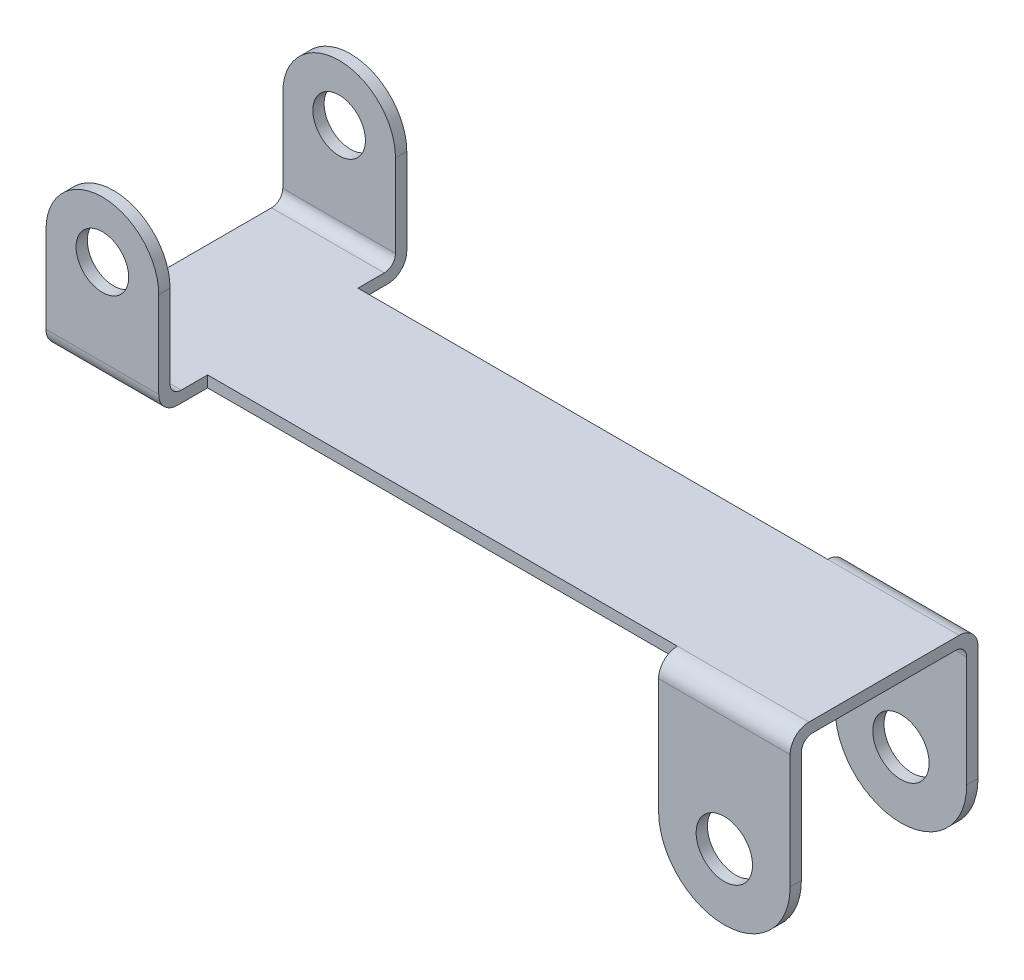
ISO-10303-21;
HEADER;
FILE_DESCRIPTION(('STEP AP214'),'2;1');
FILE_NAME('part.step','',(''),(''),'','','');
FILE_SCHEMA(('AUTOMOTIVE_DESIGN { 1 0 10303 214 1 1 1 1 }'));
ENDSEC;
DATA;
#1=APPLICATION_CONTEXT('core data for automotive mechanical design processes');
#2=APPLICATION_PROTOCOL_DEFINITION('international standard','automotive_design',2000,#1);
#3=PRODUCT_CONTEXT('',#1,'mechanical');
#4=PRODUCT('Part','Part','',(#3));
#5=PRODUCT_RELATED_PRODUCT_CATEGORY('part','',(#4));
#6=PRODUCT_DEFINITION_FORMATION('','',#4);
#7=PRODUCT_DEFINITION_CONTEXT('part definition',#1,'design');
#8=PRODUCT_DEFINITION('design','',#6,#7);
#9=PRODUCT_DEFINITION_SHAPE('','',#8);
#10=(LENGTH_UNIT() NAMED_UNIT(*) SI_UNIT(.MILLI.,.METRE.));
#11=(NAMED_UNIT(*) PLANE_ANGLE_UNIT() SI_UNIT($,.RADIAN.));
#12=(NAMED_UNIT(*) SI_UNIT($,.STERADIAN.) SOLID_ANGLE_UNIT());
#13=UNCERTAINTY_MEASURE_WITH_UNIT(LENGTH_MEASURE(1.E-05),#10,'distance_accuracy_value','');
#14=(GEOMETRIC_REPRESENTATION_CONTEXT(3) GLOBAL_UNCERTAINTY_ASSIGNED_CONTEXT((#13)) GLOBAL_UNIT_ASSIGNED_CONTEXT((#10,
#11,#12)) REPRESENTATION_CONTEXT('',''));
#15=CARTESIAN_POINT('',(0.,0.,0.));
#16=DIRECTION('',(0.,0.,1.));
#17=DIRECTION('',(1.,0.,0.));
#18=AXIS2_PLACEMENT_3D('',#15,#16,#17);
#19=CARTESIAN_POINT('',(17.25,-3.25,-0.5));
#20=DIRECTION('',(0.,0.,-1.));
#21=DIRECTION('',(-1.,0.,0.));
#22=AXIS2_PLACEMENT_3D('',#19,#20,#21);
#23=CYLINDRICAL_SURFACE('',#22,1.75);
#24=DIRECTION('',(0.,0.,1.));
#25=VECTOR('',#24,1.);
#26=CARTESIAN_POINT('',(15.5,-3.25,-0.5));
#27=LINE('',#26,#25);
#28=CARTESIAN_POINT('',(15.5,-3.25,-0.5));
#29=VERTEX_POINT('',#28);
#30=CARTESIAN_POINT('',(15.5,-3.25,-0.2));
#31=VERTEX_POINT('',#30);
#32=EDGE_CURVE('E305',#29,#31,#27,.T.);
#33=ORIENTED_EDGE('',*,*,#32,.F.);
#34=CARTESIAN_POINT('',(17.25,-3.25,-0.5));
#35=DIRECTION('',(0.,0.,-1.));
#36=DIRECTION('',(-1.,0.,0.));
#37=AXIS2_PLACEMENT_3D('',#34,#35,#36);
#38=CIRCLE('',#37,1.75);
#39=CARTESIAN_POINT('',(19.,-3.25,-0.5));
#40=VERTEX_POINT('',#39);
#41=EDGE_CURVE('E311',#40,#29,#38,.T.);
#42=ORIENTED_EDGE('',*,*,#41,.F.);
#43=DIRECTION('',(0.,0.,-1.));
#44=VECTOR('',#43,1.);
#45=CARTESIAN_POINT('',(19.,-3.25,0.));
#46=LINE('',#45,#44);
#47=CARTESIAN_POINT('',(19.,-3.25,-0.2));
#48=VERTEX_POINT('',#47);
#49=EDGE_CURVE('E308',#48,#40,#46,.T.);
#50=ORIENTED_EDGE('',*,*,#49,.F.);
#51=CARTESIAN_POINT('',(17.25,-3.25,-0.2));
#52=DIRECTION('',(0.,0.,-1.));
#53=DIRECTION('',(-1.,0.,0.));
#54=AXIS2_PLACEMENT_3D('',#51,#52,#53);
#55=CIRCLE('',#54,1.75);
#56=EDGE_CURVE('E313',#31,#48,#55,.F.);
#57=ORIENTED_EDGE('',*,*,#56,.F.);
#58=EDGE_LOOP('',(#33,#42,#50,#57));
#59=FACE_BOUND('',#58,.T.);
#60=ADVANCED_FACE('F39',(#59),#23,.T.);
#61=CARTESIAN_POINT('',(17.25,-3.25,4.2));
#62=DIRECTION('',(0.,0.,-1.));
#63=DIRECTION('',(-1.,0.,0.));
#64=AXIS2_PLACEMENT_3D('',#61,#62,#63);
#65=CYLINDRICAL_SURFACE('',#64,1.75);
#66=DIRECTION('',(0.,0.,-1.));
#67=VECTOR('',#66,1.);
#68=CARTESIAN_POINT('',(15.5,-3.25,4.));
#69=LINE('',#68,#67);
#70=CARTESIAN_POINT('',(15.5,-3.25,4.2));
#71=VERTEX_POINT('',#70);
#72=CARTESIAN_POINT('',(15.5,-3.25,4.5));
#73=VERTEX_POINT('',#72);
#74=EDGE_CURVE('E290',#71,#73,#69,.F.);
#75=ORIENTED_EDGE('',*,*,#74,.F.);
#76=CARTESIAN_POINT('',(17.25,-3.25,4.2));
#77=DIRECTION('',(0.,0.,1.));
#78=DIRECTION('',(1.,0.,0.));
#79=AXIS2_PLACEMENT_3D('',#76,#77,#78);
#80=CIRCLE('',#79,1.75);
#81=CARTESIAN_POINT('',(19.,-3.25,4.2));
#82=VERTEX_POINT('',#81);
#83=EDGE_CURVE('E301',#82,#71,#80,.F.);
#84=ORIENTED_EDGE('',*,*,#83,.F.);
#85=DIRECTION('',(0.,0.,1.));
#86=VECTOR('',#85,1.);
#87=CARTESIAN_POINT('',(19.,-3.25,4.2));
#88=LINE('',#87,#86);
#89=CARTESIAN_POINT('',(19.,-3.25,4.5));
#90=VERTEX_POINT('',#89);
#91=EDGE_CURVE('E298',#90,#82,#88,.F.);
#92=ORIENTED_EDGE('',*,*,#91,.F.);
#93=CARTESIAN_POINT('',(17.25,-3.25,4.5));
#94=DIRECTION('',(0.,0.,1.));
#95=DIRECTION('',(1.,0.,0.));
#96=AXIS2_PLACEMENT_3D('',#93,#94,#95);
#97=CIRCLE('',#96,1.75);
#98=EDGE_CURVE('E303',#73,#90,#97,.T.);
#99=ORIENTED_EDGE('',*,*,#98,.F.);
#100=EDGE_LOOP('',(#75,#84,#92,#99));
#101=FACE_BOUND('',#100,.T.);
#102=ADVANCED_FACE('F501',(#101),#65,.T.);
#103=CARTESIAN_POINT('',(0.,0.,0.));
#104=DIRECTION('',(0.,1.,0.));
#105=DIRECTION('',(0.,0.,1.));
#106=AXIS2_PLACEMENT_3D('',#103,#104,#105);
#107=PLANE('',#106);
#108=DIRECTION('',(0.,0.,1.));
#109=VECTOR('',#108,1.);
#110=CARTESIAN_POINT('',(3.,0.,4.));
#111=LINE('',#110,#109);
#112=CARTESIAN_POINT('',(3.,0.,4.));
#113=VERTEX_POINT('',#112);
#114=CARTESIAN_POINT('',(3.,0.,4.8));
#115=VERTEX_POINT('',#114);
#116=EDGE_CURVE('E238',#113,#115,#111,.T.);
#117=ORIENTED_EDGE('',*,*,#116,.T.);
#118=DIRECTION('',(-1.,0.,0.));
#119=VECTOR('',#118,1.);
#120=CARTESIAN_POINT('',(0.,0.,4.8));
#121=LINE('',#120,#119);
#122=CARTESIAN_POINT('',(0.,0.,4.8));
#123=VERTEX_POINT('',#122);
#124=EDGE_CURVE('E364',#115,#123,#121,.T.);
#125=ORIENTED_EDGE('',*,*,#124,.T.);
#126=DIRECTION('',(0.,0.,1.));
#127=VECTOR('',#126,1.);
#128=CARTESIAN_POINT('',(0.,0.,0.));
#129=LINE('',#128,#127);
#130=CARTESIAN_POINT('',(0.,0.,-0.8));
#131=VERTEX_POINT('',#130);
#132=EDGE_CURVE('E260',#131,#123,#129,.T.);
#133=ORIENTED_EDGE('',*,*,#132,.F.);
#134=DIRECTION('',(1.,0.,0.));
#135=VECTOR('',#134,1.);
#136=CARTESIAN_POINT('',(3.,0.,-0.8));
#137=LINE('',#136,#135);
#138=CARTESIAN_POINT('',(3.,0.,-0.8));
#139=VERTEX_POINT('',#138);
#140=EDGE_CURVE('E361',#131,#139,#137,.T.);
#141=ORIENTED_EDGE('',*,*,#140,.T.);
#142=DIRECTION('',(0.,0.,1.));
#143=VECTOR('',#142,1.);
#144=CARTESIAN_POINT('',(3.,0.,0.));
#145=LINE('',#144,#143);
#146=CARTESIAN_POINT('',(3.,0.,0.));
#147=VERTEX_POINT('',#146);
#148=EDGE_CURVE('E449',#139,#147,#145,.T.);
#149=ORIENTED_EDGE('',*,*,#148,.T.);
#150=DIRECTION('',(-1.,0.,0.));
#151=VECTOR('',#150,1.);
#152=CARTESIAN_POINT('',(0.,0.,0.));
#153=LINE('',#152,#151);
#154=CARTESIAN_POINT('',(15.5,0.,0.));
#155=VERTEX_POINT('',#154);
#156=EDGE_CURVE('E253',#155,#147,#153,.T.);
#157=ORIENTED_EDGE('',*,*,#156,.F.);
#158=DIRECTION('',(0.,0.,1.));
#159=VECTOR('',#158,1.);
#160=CARTESIAN_POINT('',(15.5,0.,0.));
#161=LINE('',#160,#159);
#162=CARTESIAN_POINT('',(15.5,0.,0.0999999999999998));
#163=VERTEX_POINT('',#162);
#164=EDGE_CURVE('E325',#155,#163,#161,.T.);
#165=ORIENTED_EDGE('',*,*,#164,.T.);
#166=DIRECTION('',(-1.,0.,0.));
#167=VECTOR('',#166,1.);
#168=CARTESIAN_POINT('',(19.,0.,0.0999999999999998));
#169=LINE('',#168,#167);
#170=CARTESIAN_POINT('',(19.,0.,0.0999999999999998));
#171=VERTEX_POINT('',#170);
#172=EDGE_CURVE('E323',#163,#171,#169,.F.);
#173=ORIENTED_EDGE('',*,*,#172,.T.);
#174=DIRECTION('',(0.,0.,-1.));
#175=VECTOR('',#174,1.);
#176=CARTESIAN_POINT('',(19.,0.,0.));
#177=LINE('',#176,#175);
#178=CARTESIAN_POINT('',(19.,0.,3.9));
#179=VERTEX_POINT('',#178);
#180=EDGE_CURVE('E266',#179,#171,#177,.T.);
#181=ORIENTED_EDGE('',*,*,#180,.F.);
#182=DIRECTION('',(1.,0.,0.));
#183=VECTOR('',#182,1.);
#184=CARTESIAN_POINT('',(15.5,0.,3.9));
#185=LINE('',#184,#183);
#186=CARTESIAN_POINT('',(15.5,0.,3.9));
#187=VERTEX_POINT('',#186);
#188=EDGE_CURVE('E330',#179,#187,#185,.F.);
#189=ORIENTED_EDGE('',*,*,#188,.T.);
#190=DIRECTION('',(0.,0.,1.));
#191=VECTOR('',#190,1.);
#192=CARTESIAN_POINT('',(15.5,0.,0.));
#193=LINE('',#192,#191);
#194=CARTESIAN_POINT('',(15.5,0.,4.));
#195=VERTEX_POINT('',#194);
#196=EDGE_CURVE('E328',#187,#195,#193,.T.);
#197=ORIENTED_EDGE('',*,*,#196,.T.);
#198=DIRECTION('',(1.,0.,0.));
#199=VECTOR('',#198,1.);
#200=CARTESIAN_POINT('',(0.,0.,4.));
#201=LINE('',#200,#199);
#202=EDGE_CURVE('E263',#113,#195,#201,.T.);
#203=ORIENTED_EDGE('',*,*,#202,.F.);
#204=EDGE_LOOP('',(#117,#125,#133,#141,#149,#157,#165,#173,#181,#189,#197,#203));
#205=FACE_BOUND('',#204,.T.);
#206=ADVANCED_FACE('F472',(#205),#107,.F.);
#207=CARTESIAN_POINT('',(1.5,2.8,5.));
#208=DIRECTION('',(0.,0.,-1.));
#209=DIRECTION('',(-1.,0.,0.));
#210=AXIS2_PLACEMENT_3D('',#207,#208,#209);
#211=CYLINDRICAL_SURFACE('',#210,1.5);
#212=DIRECTION('',(0.,0.,-1.));
#213=VECTOR('',#212,1.);
#214=CARTESIAN_POINT('',(3.,2.8,4.));
#215=LINE('',#214,#213);
#216=CARTESIAN_POINT('',(3.,2.8,5.));
#217=VERTEX_POINT('',#216);
#218=CARTESIAN_POINT('',(3.,2.8,5.3));
#219=VERTEX_POINT('',#218);
#220=EDGE_CURVE('E280',#217,#219,#215,.F.);
#221=ORIENTED_EDGE('',*,*,#220,.F.);
#222=CARTESIAN_POINT('',(1.5,2.8,5.));
#223=DIRECTION('',(0.,0.,1.));
#224=DIRECTION('',(1.,0.,0.));
#225=AXIS2_PLACEMENT_3D('',#222,#223,#224);
#226=CIRCLE('',#225,1.5);
#227=CARTESIAN_POINT('',(0.,2.8,5.));
#228=VERTEX_POINT('',#227);
#229=EDGE_CURVE('E286',#228,#217,#226,.F.);
#230=ORIENTED_EDGE('',*,*,#229,.F.);
#231=DIRECTION('',(0.,0.,1.));
#232=VECTOR('',#231,1.);
#233=CARTESIAN_POINT('',(0.,2.8,5.));
#234=LINE('',#233,#232);
#235=CARTESIAN_POINT('',(0.,2.8,5.3));
#236=VERTEX_POINT('',#235);
#237=EDGE_CURVE('E283',#236,#228,#234,.F.);
#238=ORIENTED_EDGE('',*,*,#237,.F.);
#239=CARTESIAN_POINT('',(1.5,2.8,5.3));
#240=DIRECTION('',(0.,0.,1.));
#241=DIRECTION('',(1.,0.,0.));
#242=AXIS2_PLACEMENT_3D('',#239,#240,#241);
#243=CIRCLE('',#242,1.5);
#244=EDGE_CURVE('E288',#219,#236,#243,.T.);
#245=ORIENTED_EDGE('',*,*,#244,.F.);
#246=EDGE_LOOP('',(#221,#230,#238,#245));
#247=FACE_BOUND('',#246,.T.);
#248=ADVANCED_FACE('F692',(#247),#211,.T.);
#249=CARTESIAN_POINT('',(1.5,2.8,-1.3));
#250=DIRECTION('',(0.,0.,-1.));
#251=DIRECTION('',(-1.,0.,0.));
#252=AXIS2_PLACEMENT_3D('',#249,#250,#251);
#253=CYLINDRICAL_SURFACE('',#252,1.5);
#254=DIRECTION('',(0.,0.,-1.));
#255=VECTOR('',#254,1.);
#256=CARTESIAN_POINT('',(3.,2.8,0.));
#257=LINE('',#256,#255);
#258=CARTESIAN_POINT('',(3.,2.8,-1.3));
#259=VERTEX_POINT('',#258);
#260=CARTESIAN_POINT('',(3.,2.8,-1.));
#261=VERTEX_POINT('',#260);
#262=EDGE_CURVE('E259',#259,#261,#257,.F.);
#263=ORIENTED_EDGE('',*,*,#262,.F.);
#264=CARTESIAN_POINT('',(1.5,2.8,-1.3));
#265=DIRECTION('',(0.,0.,-1.));
#266=DIRECTION('',(-1.,0.,0.));
#267=AXIS2_PLACEMENT_3D('',#264,#265,#266);
#268=CIRCLE('',#267,1.5);
#269=CARTESIAN_POINT('',(0.,2.8,-1.3));
#270=VERTEX_POINT('',#269);
#271=EDGE_CURVE('E276',#270,#259,#268,.T.);
#272=ORIENTED_EDGE('',*,*,#271,.F.);
#273=DIRECTION('',(0.,0.,1.));
#274=VECTOR('',#273,1.);
#275=CARTESIAN_POINT('',(0.,2.8,-1.3));
#276=LINE('',#275,#274);
#277=CARTESIAN_POINT('',(0.,2.8,-1.));
#278=VERTEX_POINT('',#277);
#279=EDGE_CURVE('E273',#278,#270,#276,.F.);
#280=ORIENTED_EDGE('',*,*,#279,.F.);
#281=CARTESIAN_POINT('',(1.5,2.8,-1.));
#282=DIRECTION('',(0.,0.,-1.));
#283=DIRECTION('',(-1.,0.,0.));
#284=AXIS2_PLACEMENT_3D('',#281,#282,#283);
#285=CIRCLE('',#284,1.5);
#286=EDGE_CURVE('E278',#261,#278,#285,.F.);
#287=ORIENTED_EDGE('',*,*,#286,.F.);
#288=EDGE_LOOP('',(#263,#272,#280,#287));
#289=FACE_BOUND('',#288,.T.);
#290=ADVANCED_FACE('F487',(#289),#253,.T.);
#291=CARTESIAN_POINT('',(0.,0.3,0.));
#292=DIRECTION('',(0.,1.,0.));
#293=DIRECTION('',(0.,0.,1.));
#294=AXIS2_PLACEMENT_3D('',#291,#292,#293);
#295=PLANE('',#294);
#296=DIRECTION('',(1.,0.,0.));
#297=VECTOR('',#296,1.);
#298=CARTESIAN_POINT('',(0.,0.3,4.));
#299=LINE('',#298,#297);
#300=CARTESIAN_POINT('',(3.,0.3,4.));
#301=VERTEX_POINT('',#300);
#302=CARTESIAN_POINT('',(15.5,0.3,4.));
#303=VERTEX_POINT('',#302);
#304=EDGE_CURVE('E224',#301,#303,#299,.T.);
#305=ORIENTED_EDGE('',*,*,#304,.T.);
#306=DIRECTION('',(1.,0.,0.));
#307=VECTOR('',#306,1.);
#308=CARTESIAN_POINT('',(0.,0.3,4.00000000000001));
#309=LINE('',#308,#307);
#310=CARTESIAN_POINT('',(19.,0.3,4.));
#311=VERTEX_POINT('',#310);
#312=EDGE_CURVE('E382',#303,#311,#309,.T.);
#313=ORIENTED_EDGE('',*,*,#312,.T.);
#314=DIRECTION('',(0.,0.,-1.));
#315=VECTOR('',#314,1.);
#316=CARTESIAN_POINT('',(19.,0.3,0.));
#317=LINE('',#316,#315);
#318=CARTESIAN_POINT('',(19.,0.3,0.));
#319=VERTEX_POINT('',#318);
#320=EDGE_CURVE('E247',#311,#319,#317,.T.);
#321=ORIENTED_EDGE('',*,*,#320,.T.);
#322=DIRECTION('',(-1.,0.,0.));
#323=VECTOR('',#322,1.);
#324=CARTESIAN_POINT('',(0.,0.3,0.));
#325=LINE('',#324,#323);
#326=CARTESIAN_POINT('',(15.5,0.3,0.));
#327=VERTEX_POINT('',#326);
#328=EDGE_CURVE('E379',#319,#327,#325,.T.);
#329=ORIENTED_EDGE('',*,*,#328,.T.);
#330=DIRECTION('',(-1.,0.,0.));
#331=VECTOR('',#330,1.);
#332=CARTESIAN_POINT('',(0.,0.3,0.));
#333=LINE('',#332,#331);
#334=CARTESIAN_POINT('',(3.,0.3,0.));
#335=VERTEX_POINT('',#334);
#336=EDGE_CURVE('E251',#327,#335,#333,.T.);
#337=ORIENTED_EDGE('',*,*,#336,.T.);
#338=DIRECTION('',(0.,0.,1.));
#339=VECTOR('',#338,1.);
#340=CARTESIAN_POINT('',(3.,0.3,0.));
#341=LINE('',#340,#339);
#342=CARTESIAN_POINT('',(3.,0.3,-0.7));
#343=VERTEX_POINT('',#342);
#344=EDGE_CURVE('E453',#343,#335,#341,.T.);
#345=ORIENTED_EDGE('',*,*,#344,.F.);
#346=DIRECTION('',(1.,0.,0.));
#347=VECTOR('',#346,1.);
#348=CARTESIAN_POINT('',(0.,0.3,-0.7));
#349=LINE('',#348,#347);
#350=CARTESIAN_POINT('',(0.,0.3,-0.7));
#351=VERTEX_POINT('',#350);
#352=EDGE_CURVE('E340',#343,#351,#349,.F.);
#353=ORIENTED_EDGE('',*,*,#352,.T.);
#354=DIRECTION('',(0.,0.,1.));
#355=VECTOR('',#354,1.);
#356=CARTESIAN_POINT('',(0.,0.3,0.));
#357=LINE('',#356,#355);
#358=CARTESIAN_POINT('',(0.,0.3,4.7));
#359=VERTEX_POINT('',#358);
#360=EDGE_CURVE('E248',#351,#359,#357,.T.);
#361=ORIENTED_EDGE('',*,*,#360,.T.);
#362=DIRECTION('',(-1.,0.,0.));
#363=VECTOR('',#362,1.);
#364=CARTESIAN_POINT('',(0.,0.3,4.7));
#365=LINE('',#364,#363);
#366=CARTESIAN_POINT('',(3.,0.3,4.7));
#367=VERTEX_POINT('',#366);
#368=EDGE_CURVE('E228',#359,#367,#365,.F.);
#369=ORIENTED_EDGE('',*,*,#368,.T.);
#370=DIRECTION('',(0.,0.,1.));
#371=VECTOR('',#370,1.);
#372=CARTESIAN_POINT('',(3.,0.3,4.));
#373=LINE('',#372,#371);
#374=EDGE_CURVE('E219',#301,#367,#373,.T.);
#375=ORIENTED_EDGE('',*,*,#374,.F.);
#376=EDGE_LOOP('',(#305,#313,#321,#329,#337,#345,#353,#361,#369,#375));
#377=FACE_BOUND('',#376,.T.);
#378=ADVANCED_FACE('F221',(#377),#295,.T.);
#379=CARTESIAN_POINT('',(0.,0.3,0.));
#380=DIRECTION('',(0.,0.,1.));
#381=DIRECTION('',(1.,0.,0.));
#382=AXIS2_PLACEMENT_3D('',#379,#380,#381);
#383=PLANE('',#382);
#384=ORIENTED_EDGE('',*,*,#336,.F.);
#385=DIRECTION('',(0.,1.,0.));
#386=VECTOR('',#385,1.);
#387=CARTESIAN_POINT('',(15.5,-3.53553390593274,0.));
#388=LINE('',#387,#386);
#389=EDGE_CURVE('E413',#155,#327,#388,.T.);
#390=ORIENTED_EDGE('',*,*,#389,.F.);
#391=ORIENTED_EDGE('',*,*,#156,.T.);
#392=DIRECTION('',(0.,-1.,0.));
#393=VECTOR('',#392,1.);
#394=CARTESIAN_POINT('',(3.,3.56955654485436,0.));
#395=LINE('',#394,#393);
#396=EDGE_CURVE('E415',#335,#147,#395,.T.);
#397=ORIENTED_EDGE('',*,*,#396,.F.);
#398=EDGE_LOOP('',(#384,#390,#391,#397));
#399=FACE_BOUND('',#398,.T.);
#400=ADVANCED_FACE('F412',(#399),#383,.F.);
#401=CARTESIAN_POINT('',(0.,0.3,0.));
#402=DIRECTION('',(1.,0.,0.));
#403=DIRECTION('',(0.,0.,-1.));
#404=AXIS2_PLACEMENT_3D('',#401,#402,#403);
#405=PLANE('',#404);
#406=ORIENTED_EDGE('',*,*,#132,.T.);
#407=CARTESIAN_POINT('',(0.,0.5,4.8));
#408=DIRECTION('',(1.,0.,0.));
#409=DIRECTION('',(0.,0.,-1.));
#410=AXIS2_PLACEMENT_3D('',#407,#408,#409);
#411=CIRCLE('',#410,0.5);
#412=CARTESIAN_POINT('',(0.,0.5,5.3));
#413=VERTEX_POINT('',#412);
#414=EDGE_CURVE('E369',#123,#413,#411,.F.);
#415=ORIENTED_EDGE('',*,*,#414,.T.);
#416=DIRECTION('',(0.,-1.,0.));
#417=VECTOR('',#416,1.);
#418=CARTESIAN_POINT('',(0.,3.56955654485436,5.3));
#419=LINE('',#418,#417);
#420=EDGE_CURVE('E446',#236,#413,#419,.T.);
#421=ORIENTED_EDGE('',*,*,#420,.F.);
#422=ORIENTED_EDGE('',*,*,#237,.T.);
#423=DIRECTION('',(0.,-1.,0.));
#424=VECTOR('',#423,1.);
#425=CARTESIAN_POINT('',(0.,4.3,5.));
#426=LINE('',#425,#424);
#427=CARTESIAN_POINT('',(0.,0.6,5.));
#428=VERTEX_POINT('',#427);
#429=EDGE_CURVE('E433',#228,#428,#426,.T.);
#430=ORIENTED_EDGE('',*,*,#429,.T.);
#431=CARTESIAN_POINT('',(0.,0.6,4.7));
#432=DIRECTION('',(1.,0.,0.));
#433=DIRECTION('',(0.,0.,-1.));
#434=AXIS2_PLACEMENT_3D('',#431,#432,#433);
#435=CIRCLE('',#434,0.3);
#436=EDGE_CURVE('E357',#428,#359,#435,.T.);
#437=ORIENTED_EDGE('',*,*,#436,.T.);
#438=ORIENTED_EDGE('',*,*,#360,.F.);
#439=CARTESIAN_POINT('',(0.,0.6,-0.7));
#440=DIRECTION('',(1.,0.,0.));
#441=DIRECTION('',(0.,0.,-1.));
#442=AXIS2_PLACEMENT_3D('',#439,#440,#441);
#443=CIRCLE('',#442,0.3);
#444=CARTESIAN_POINT('',(0.,0.6,-1.));
#445=VERTEX_POINT('',#444);
#446=EDGE_CURVE('E355',#351,#445,#443,.T.);
#447=ORIENTED_EDGE('',*,*,#446,.T.);
#448=DIRECTION('',(0.,-1.,0.));
#449=VECTOR('',#448,1.);
#450=CARTESIAN_POINT('',(0.,4.3,-1.));
#451=LINE('',#450,#449);
#452=EDGE_CURVE('E442',#278,#445,#451,.T.);
#453=ORIENTED_EDGE('',*,*,#452,.F.);
#454=ORIENTED_EDGE('',*,*,#279,.T.);
#455=DIRECTION('',(0.,-1.,0.));
#456=VECTOR('',#455,1.);
#457=CARTESIAN_POINT('',(0.,3.56955654485436,-1.3));
#458=LINE('',#457,#456);
#459=CARTESIAN_POINT('',(0.,0.5,-1.3));
#460=VERTEX_POINT('',#459);
#461=EDGE_CURVE('E264',#270,#460,#458,.T.);
#462=ORIENTED_EDGE('',*,*,#461,.T.);
#463=CARTESIAN_POINT('',(0.,0.5,-0.8));
#464=DIRECTION('',(1.,0.,0.));
#465=DIRECTION('',(0.,0.,-1.));
#466=AXIS2_PLACEMENT_3D('',#463,#464,#465);
#467=CIRCLE('',#466,0.5);
#468=EDGE_CURVE('E367',#460,#131,#467,.F.);
#469=ORIENTED_EDGE('',*,*,#468,.T.);
#470=EDGE_LOOP('',(#406,#415,#421,#422,#430,#437,#438,#447,#453,#454,#462,#469));
#471=FACE_BOUND('',#470,.T.);
#472=ADVANCED_FACE('F461',(#471),#405,.F.);
#473=CARTESIAN_POINT('',(0.,0.3,4.));
#474=DIRECTION('',(0.,0.,-1.));
#475=DIRECTION('',(-1.,0.,0.));
#476=AXIS2_PLACEMENT_3D('',#473,#474,#475);
#477=PLANE('',#476);
#478=ORIENTED_EDGE('',*,*,#202,.T.);
#479=DIRECTION('',(0.,1.,0.));
#480=VECTOR('',#479,1.);
#481=CARTESIAN_POINT('',(15.5,-3.53553390593274,4.));
#482=LINE('',#481,#480);
#483=EDGE_CURVE('E246',#195,#303,#482,.T.);
#484=ORIENTED_EDGE('',*,*,#483,.T.);
#485=ORIENTED_EDGE('',*,*,#304,.F.);
#486=DIRECTION('',(0.,-1.,0.));
#487=VECTOR('',#486,1.);
#488=CARTESIAN_POINT('',(3.,3.56955654485436,4.));
#489=LINE('',#488,#487);
#490=EDGE_CURVE('E232',#301,#113,#489,.T.);
#491=ORIENTED_EDGE('',*,*,#490,.T.);
#492=EDGE_LOOP('',(#478,#484,#485,#491));
#493=FACE_BOUND('',#492,.T.);
#494=ADVANCED_FACE('F244',(#493),#477,.F.);
#495=CARTESIAN_POINT('',(19.,0.3,0.));
#496=DIRECTION('',(-1.,0.,0.));
#497=DIRECTION('',(0.,0.,1.));
#498=AXIS2_PLACEMENT_3D('',#495,#496,#497);
#499=PLANE('',#498);
#500=ORIENTED_EDGE('',*,*,#320,.F.);
#501=CARTESIAN_POINT('',(19.,-0.2,4.));
#502=DIRECTION('',(-1.,0.,0.));
#503=DIRECTION('',(0.,0.,1.));
#504=AXIS2_PLACEMENT_3D('',#501,#502,#503);
#505=CIRCLE('',#504,0.5);
#506=CARTESIAN_POINT('',(19.,-0.2,4.5));
#507=VERTEX_POINT('',#506);
#508=EDGE_CURVE('E386',#311,#507,#505,.F.);
#509=ORIENTED_EDGE('',*,*,#508,.T.);
#510=DIRECTION('',(0.,1.,0.));
#511=VECTOR('',#510,1.);
#512=CARTESIAN_POINT('',(19.,-3.53553390593274,4.5));
#513=LINE('',#512,#511);
#514=EDGE_CURVE('E428',#90,#507,#513,.T.);
#515=ORIENTED_EDGE('',*,*,#514,.F.);
#516=ORIENTED_EDGE('',*,*,#91,.T.);
#517=DIRECTION('',(0.,1.,0.));
#518=VECTOR('',#517,1.);
#519=CARTESIAN_POINT('',(19.,-5.,4.2));
#520=LINE('',#519,#518);
#521=CARTESIAN_POINT('',(19.,-0.3,4.2));
#522=VERTEX_POINT('',#521);
#523=EDGE_CURVE('E825',#82,#522,#520,.T.);
#524=ORIENTED_EDGE('',*,*,#523,.T.);
#525=CARTESIAN_POINT('',(19.,-0.3,3.9));
#526=DIRECTION('',(-1.,0.,0.));
#527=DIRECTION('',(0.,0.,1.));
#528=AXIS2_PLACEMENT_3D('',#525,#526,#527);
#529=CIRCLE('',#528,0.3);
#530=EDGE_CURVE('E345',#522,#179,#529,.T.);
#531=ORIENTED_EDGE('',*,*,#530,.T.);
#532=ORIENTED_EDGE('',*,*,#180,.T.);
#533=CARTESIAN_POINT('',(19.,-0.3,0.0999999999999998));
#534=DIRECTION('',(-1.,0.,0.));
#535=DIRECTION('',(0.,0.,1.));
#536=AXIS2_PLACEMENT_3D('',#533,#534,#535);
#537=CIRCLE('',#536,0.3);
#538=CARTESIAN_POINT('',(19.,-0.3,-0.2));
#539=VERTEX_POINT('',#538);
#540=EDGE_CURVE('E351',#171,#539,#537,.T.);
#541=ORIENTED_EDGE('',*,*,#540,.T.);
#542=DIRECTION('',(0.,1.,0.));
#543=VECTOR('',#542,1.);
#544=CARTESIAN_POINT('',(19.,-5.,-0.2));
#545=LINE('',#544,#543);
#546=EDGE_CURVE('E832',#48,#539,#545,.T.);
#547=ORIENTED_EDGE('',*,*,#546,.F.);
#548=ORIENTED_EDGE('',*,*,#49,.T.);
#549=DIRECTION('',(0.,1.,0.));
#550=VECTOR('',#549,1.);
#551=CARTESIAN_POINT('',(19.,-3.53553390593274,-0.5));
#552=LINE('',#551,#550);
#553=CARTESIAN_POINT('',(19.,-0.2,-0.5));
#554=VERTEX_POINT('',#553);
#555=EDGE_CURVE('E404',#40,#554,#552,.T.);
#556=ORIENTED_EDGE('',*,*,#555,.T.);
#557=CARTESIAN_POINT('',(19.,-0.2,0.));
#558=DIRECTION('',(-1.,0.,0.));
#559=DIRECTION('',(0.,0.,1.));
#560=AXIS2_PLACEMENT_3D('',#557,#558,#559);
#561=CIRCLE('',#560,0.5);
#562=EDGE_CURVE('E384',#554,#319,#561,.F.);
#563=ORIENTED_EDGE('',*,*,#562,.T.);
#564=EDGE_LOOP('',(#500,#509,#515,#516,#524,#531,#532,#541,#547,#548,#556,#563));
#565=FACE_BOUND('',#564,.T.);
#566=ADVANCED_FACE('F399',(#565),#499,.F.);
#567=CARTESIAN_POINT('',(0.,3.56955654485436,-1.3));
#568=DIRECTION('',(0.,0.,-1.));
#569=DIRECTION('',(-1.,0.,0.));
#570=AXIS2_PLACEMENT_3D('',#567,#568,#569);
#571=PLANE('',#570);
#572=CARTESIAN_POINT('',(1.5,2.79999999999999,-1.3));
#573=DIRECTION('',(0.,0.,-1.));
#574=DIRECTION('',(-1.,0.,0.));
#575=AXIS2_PLACEMENT_3D('',#572,#573,#574);
#576=CIRCLE('',#575,0.7);
#577=CARTESIAN_POINT('',(0.8,2.79999999999999,-1.3));
#578=VERTEX_POINT('',#577);
#579=EDGE_CURVE('E418',#578,#578,#576,.T.);
#580=ORIENTED_EDGE('',*,*,#579,.F.);
#581=EDGE_LOOP('',(#580));
#582=FACE_BOUND('',#581,.T.);
#583=DIRECTION('',(0.,-1.,0.));
#584=VECTOR('',#583,1.);
#585=CARTESIAN_POINT('',(3.,3.56955654485436,-1.3));
#586=LINE('',#585,#584);
#587=CARTESIAN_POINT('',(3.,0.5,-1.3));
#588=VERTEX_POINT('',#587);
#589=EDGE_CURVE('E452',#259,#588,#586,.T.);
#590=ORIENTED_EDGE('',*,*,#589,.T.);
#591=DIRECTION('',(1.,0.,0.));
#592=VECTOR('',#591,1.);
#593=CARTESIAN_POINT('',(0.,0.5,-1.3));
#594=LINE('',#593,#592);
#595=EDGE_CURVE('E377',#588,#460,#594,.F.);
#596=ORIENTED_EDGE('',*,*,#595,.T.);
#597=ORIENTED_EDGE('',*,*,#461,.F.);
#598=ORIENTED_EDGE('',*,*,#271,.T.);
#599=EDGE_LOOP('',(#590,#596,#597,#598));
#600=FACE_BOUND('',#599,.T.);
#601=ADVANCED_FACE('F488',(#582,#600),#571,.T.);
#602=CARTESIAN_POINT('',(3.,3.56955654485436,0.));
#603=DIRECTION('',(1.,0.,0.));
#604=DIRECTION('',(0.,0.,-1.));
#605=AXIS2_PLACEMENT_3D('',#602,#603,#604);
#606=PLANE('',#605);
#607=ORIENTED_EDGE('',*,*,#148,.F.);
#608=CARTESIAN_POINT('',(3.,0.5,-0.8));
#609=DIRECTION('',(1.,0.,0.));
#610=DIRECTION('',(0.,0.,-1.));
#611=AXIS2_PLACEMENT_3D('',#608,#609,#610);
#612=CIRCLE('',#611,0.5);
#613=EDGE_CURVE('E375',#139,#588,#612,.T.);
#614=ORIENTED_EDGE('',*,*,#613,.T.);
#615=ORIENTED_EDGE('',*,*,#589,.F.);
#616=ORIENTED_EDGE('',*,*,#262,.T.);
#617=DIRECTION('',(0.,-1.,0.));
#618=VECTOR('',#617,1.);
#619=CARTESIAN_POINT('',(3.,4.3,-1.));
#620=LINE('',#619,#618);
#621=CARTESIAN_POINT('',(3.,0.6,-1.));
#622=VERTEX_POINT('',#621);
#623=EDGE_CURVE('E439',#261,#622,#620,.T.);
#624=ORIENTED_EDGE('',*,*,#623,.T.);
#625=CARTESIAN_POINT('',(3.,0.6,-0.7));
#626=DIRECTION('',(1.,0.,0.));
#627=DIRECTION('',(0.,0.,-1.));
#628=AXIS2_PLACEMENT_3D('',#625,#626,#627);
#629=CIRCLE('',#628,0.3);
#630=EDGE_CURVE('E353',#622,#343,#629,.F.);
#631=ORIENTED_EDGE('',*,*,#630,.T.);
#632=ORIENTED_EDGE('',*,*,#344,.T.);
#633=ORIENTED_EDGE('',*,*,#396,.T.);
#634=EDGE_LOOP('',(#607,#614,#615,#616,#624,#631,#632,#633));
#635=FACE_BOUND('',#634,.T.);
#636=ADVANCED_FACE('F474',(#635),#606,.T.);
#637=CARTESIAN_POINT('',(3.,3.56955654485436,4.));
#638=DIRECTION('',(1.,0.,0.));
#639=DIRECTION('',(0.,0.,-1.));
#640=AXIS2_PLACEMENT_3D('',#637,#638,#639);
#641=PLANE('',#640);
#642=DIRECTION('',(0.,-1.,0.));
#643=VECTOR('',#642,1.);
#644=CARTESIAN_POINT('',(3.,3.56955654485436,5.3));
#645=LINE('',#644,#643);
#646=CARTESIAN_POINT('',(3.,0.5,5.3));
#647=VERTEX_POINT('',#646);
#648=EDGE_CURVE('E231',#219,#647,#645,.T.);
#649=ORIENTED_EDGE('',*,*,#648,.T.);
#650=CARTESIAN_POINT('',(3.,0.5,4.8));
#651=DIRECTION('',(1.,0.,0.));
#652=DIRECTION('',(0.,0.,-1.));
#653=AXIS2_PLACEMENT_3D('',#650,#651,#652);
#654=CIRCLE('',#653,0.5);
#655=EDGE_CURVE('E373',#647,#115,#654,.T.);
#656=ORIENTED_EDGE('',*,*,#655,.T.);
#657=ORIENTED_EDGE('',*,*,#116,.F.);
#658=ORIENTED_EDGE('',*,*,#490,.F.);
#659=ORIENTED_EDGE('',*,*,#374,.T.);
#660=CARTESIAN_POINT('',(3.,0.6,4.7));
#661=DIRECTION('',(1.,0.,0.));
#662=DIRECTION('',(0.,0.,-1.));
#663=AXIS2_PLACEMENT_3D('',#660,#661,#662);
#664=CIRCLE('',#663,0.3);
#665=CARTESIAN_POINT('',(3.,0.6,5.));
#666=VERTEX_POINT('',#665);
#667=EDGE_CURVE('E359',#367,#666,#664,.F.);
#668=ORIENTED_EDGE('',*,*,#667,.T.);
#669=DIRECTION('',(0.,-1.,0.));
#670=VECTOR('',#669,1.);
#671=CARTESIAN_POINT('',(3.,4.3,5.));
#672=LINE('',#671,#670);
#673=EDGE_CURVE('E436',#217,#666,#672,.T.);
#674=ORIENTED_EDGE('',*,*,#673,.F.);
#675=ORIENTED_EDGE('',*,*,#220,.T.);
#676=EDGE_LOOP('',(#649,#656,#657,#658,#659,#668,#674,#675));
#677=FACE_BOUND('',#676,.T.);
#678=ADVANCED_FACE('F236',(#677),#641,.T.);
#679=CARTESIAN_POINT('',(0.,3.56955654485436,5.3));
#680=DIRECTION('',(0.,0.,1.));
#681=DIRECTION('',(1.,0.,0.));
#682=AXIS2_PLACEMENT_3D('',#679,#680,#681);
#683=PLANE('',#682);
#684=CARTESIAN_POINT('',(1.5,2.79999999999999,5.3));
#685=DIRECTION('',(0.,0.,-1.));
#686=DIRECTION('',(-1.,0.,0.));
#687=AXIS2_PLACEMENT_3D('',#684,#685,#686);
#688=CIRCLE('',#687,0.7);
#689=CARTESIAN_POINT('',(0.8,2.79999999999999,5.3));
#690=VERTEX_POINT('',#689);
#691=EDGE_CURVE('E295',#690,#690,#688,.T.);
#692=ORIENTED_EDGE('',*,*,#691,.T.);
#693=EDGE_LOOP('',(#692));
#694=FACE_BOUND('',#693,.T.);
#695=ORIENTED_EDGE('',*,*,#420,.T.);
#696=DIRECTION('',(-1.,0.,0.));
#697=VECTOR('',#696,1.);
#698=CARTESIAN_POINT('',(3.,0.5,5.3));
#699=LINE('',#698,#697);
#700=EDGE_CURVE('E371',#413,#647,#699,.F.);
#701=ORIENTED_EDGE('',*,*,#700,.T.);
#702=ORIENTED_EDGE('',*,*,#648,.F.);
#703=ORIENTED_EDGE('',*,*,#244,.T.);
#704=EDGE_LOOP('',(#695,#701,#702,#703));
#705=FACE_BOUND('',#704,.T.);
#706=ADVANCED_FACE('F775',(#694,#705),#683,.T.);
#707=CARTESIAN_POINT('',(0.,4.3,-1.));
#708=DIRECTION('',(0.,0.,-1.));
#709=DIRECTION('',(-1.,0.,0.));
#710=AXIS2_PLACEMENT_3D('',#707,#708,#709);
#711=PLANE('',#710);
#712=CARTESIAN_POINT('',(1.5,2.79999999999999,-1.));
#713=DIRECTION('',(0.,0.,-1.));
#714=DIRECTION('',(-1.,0.,0.));
#715=AXIS2_PLACEMENT_3D('',#712,#713,#714);
#716=CIRCLE('',#715,0.7);
#717=CARTESIAN_POINT('',(0.8,2.79999999999999,-1.));
#718=VERTEX_POINT('',#717);
#719=EDGE_CURVE('E294',#718,#718,#716,.T.);
#720=ORIENTED_EDGE('',*,*,#719,.T.);
#721=EDGE_LOOP('',(#720));
#722=FACE_BOUND('',#721,.T.);
#723=ORIENTED_EDGE('',*,*,#452,.T.);
#724=DIRECTION('',(1.,0.,0.));
#725=VECTOR('',#724,1.);
#726=CARTESIAN_POINT('',(0.,0.6,-1.));
#727=LINE('',#726,#725);
#728=EDGE_CURVE('E336',#445,#622,#727,.T.);
#729=ORIENTED_EDGE('',*,*,#728,.T.);
#730=ORIENTED_EDGE('',*,*,#623,.F.);
#731=ORIENTED_EDGE('',*,*,#286,.T.);
#732=EDGE_LOOP('',(#723,#729,#730,#731));
#733=FACE_BOUND('',#732,.T.);
#734=ADVANCED_FACE('F483',(#722,#733),#711,.F.);
#735=CARTESIAN_POINT('',(3.,4.3,5.));
#736=DIRECTION('',(0.,0.,1.));
#737=DIRECTION('',(1.,0.,0.));
#738=AXIS2_PLACEMENT_3D('',#735,#736,#737);
#739=PLANE('',#738);
#740=CARTESIAN_POINT('',(1.5,2.79999999999999,5.));
#741=DIRECTION('',(0.,0.,1.));
#742=DIRECTION('',(1.,0.,0.));
#743=AXIS2_PLACEMENT_3D('',#740,#741,#742);
#744=CIRCLE('',#743,0.7);
#745=CARTESIAN_POINT('',(2.2,2.79999999999999,5.));
#746=VERTEX_POINT('',#745);
#747=EDGE_CURVE('E291',#746,#746,#744,.T.);
#748=ORIENTED_EDGE('',*,*,#747,.T.);
#749=EDGE_LOOP('',(#748));
#750=FACE_BOUND('',#749,.T.);
#751=ORIENTED_EDGE('',*,*,#673,.T.);
#752=DIRECTION('',(-1.,0.,0.));
#753=VECTOR('',#752,1.);
#754=CARTESIAN_POINT('',(3.,0.6,5.));
#755=LINE('',#754,#753);
#756=EDGE_CURVE('E342',#666,#428,#755,.T.);
#757=ORIENTED_EDGE('',*,*,#756,.T.);
#758=ORIENTED_EDGE('',*,*,#429,.F.);
#759=ORIENTED_EDGE('',*,*,#229,.T.);
#760=EDGE_LOOP('',(#751,#757,#758,#759));
#761=FACE_BOUND('',#760,.T.);
#762=ADVANCED_FACE('F732',(#750,#761),#739,.F.);
#763=CARTESIAN_POINT('',(1.5,2.79999999999999,5.3));
#764=DIRECTION('',(0.,0.,-1.));
#765=DIRECTION('',(-1.,0.,0.));
#766=AXIS2_PLACEMENT_3D('',#763,#764,#765);
#767=CYLINDRICAL_SURFACE('',#766,0.7);
#768=ORIENTED_EDGE('',*,*,#691,.F.);
#769=EDGE_LOOP('',(#768));
#770=FACE_BOUND('',#769,.T.);
#771=ORIENTED_EDGE('',*,*,#747,.F.);
#772=EDGE_LOOP('',(#771));
#773=FACE_BOUND('',#772,.T.);
#774=ADVANCED_FACE('F730',(#770,#773),#767,.F.);
#775=ORIENTED_EDGE('',*,*,#579,.T.);
#776=EDGE_LOOP('',(#775));
#777=FACE_BOUND('',#776,.T.);
#778=ORIENTED_EDGE('',*,*,#719,.F.);
#779=EDGE_LOOP('',(#778));
#780=FACE_BOUND('',#779,.T.);
#781=ADVANCED_FACE('F648',(#777,#780),#767,.F.);
#782=CARTESIAN_POINT('',(15.5,-3.53553390593274,0.));
#783=DIRECTION('',(-1.,0.,0.));
#784=DIRECTION('',(0.,0.,1.));
#785=AXIS2_PLACEMENT_3D('',#782,#783,#784);
#786=PLANE('',#785);
#787=ORIENTED_EDGE('',*,*,#389,.T.);
#788=CARTESIAN_POINT('',(15.5,-0.2,0.));
#789=DIRECTION('',(-1.,0.,0.));
#790=DIRECTION('',(0.,0.,1.));
#791=AXIS2_PLACEMENT_3D('',#788,#789,#790);
#792=CIRCLE('',#791,0.5);
#793=CARTESIAN_POINT('',(15.5,-0.2,-0.5));
#794=VERTEX_POINT('',#793);
#795=EDGE_CURVE('E47',#327,#794,#792,.T.);
#796=ORIENTED_EDGE('',*,*,#795,.T.);
#797=DIRECTION('',(0.,1.,0.));
#798=VECTOR('',#797,1.);
#799=CARTESIAN_POINT('',(15.5,-3.53553390593274,-0.5));
#800=LINE('',#799,#798);
#801=EDGE_CURVE('E419',#29,#794,#800,.T.);
#802=ORIENTED_EDGE('',*,*,#801,.F.);
#803=ORIENTED_EDGE('',*,*,#32,.T.);
#804=DIRECTION('',(0.,1.,0.));
#805=VECTOR('',#804,1.);
#806=CARTESIAN_POINT('',(15.5,-5.,-0.2));
#807=LINE('',#806,#805);
#808=CARTESIAN_POINT('',(15.5,-0.3,-0.2));
#809=VERTEX_POINT('',#808);
#810=EDGE_CURVE('E824',#31,#809,#807,.T.);
#811=ORIENTED_EDGE('',*,*,#810,.T.);
#812=CARTESIAN_POINT('',(15.5,-0.3,0.0999999999999998));
#813=DIRECTION('',(-1.,0.,0.));
#814=DIRECTION('',(0.,0.,1.));
#815=AXIS2_PLACEMENT_3D('',#812,#813,#814);
#816=CIRCLE('',#815,0.3);
#817=EDGE_CURVE('E349',#809,#163,#816,.F.);
#818=ORIENTED_EDGE('',*,*,#817,.T.);
#819=ORIENTED_EDGE('',*,*,#164,.F.);
#820=EDGE_LOOP('',(#787,#796,#802,#803,#811,#818,#819));
#821=FACE_BOUND('',#820,.T.);
#822=ADVANCED_FACE('F416',(#821),#786,.T.);
#823=CARTESIAN_POINT('',(19.,-3.53553390593274,-0.5));
#824=DIRECTION('',(0.,0.,-1.));
#825=DIRECTION('',(-1.,0.,0.));
#826=AXIS2_PLACEMENT_3D('',#823,#824,#825);
#827=PLANE('',#826);
#828=CARTESIAN_POINT('',(17.25,-3.25,-0.5));
#829=DIRECTION('',(0.,0.,-1.));
#830=DIRECTION('',(-1.,0.,0.));
#831=AXIS2_PLACEMENT_3D('',#828,#829,#830);
#832=CIRCLE('',#831,0.750000000000002);
#833=CARTESIAN_POINT('',(16.5,-3.25,-0.5));
#834=VERTEX_POINT('',#833);
#835=EDGE_CURVE('E841',#834,#834,#832,.T.);
#836=ORIENTED_EDGE('',*,*,#835,.F.);
#837=EDGE_LOOP('',(#836));
#838=FACE_BOUND('',#837,.T.);
#839=ORIENTED_EDGE('',*,*,#801,.T.);
#840=DIRECTION('',(-1.,0.,0.));
#841=VECTOR('',#840,1.);
#842=CARTESIAN_POINT('',(19.,-0.2,-0.5));
#843=LINE('',#842,#841);
#844=EDGE_CURVE('E11',#794,#554,#843,.F.);
#845=ORIENTED_EDGE('',*,*,#844,.T.);
#846=ORIENTED_EDGE('',*,*,#555,.F.);
#847=ORIENTED_EDGE('',*,*,#41,.T.);
#848=EDGE_LOOP('',(#839,#845,#846,#847));
#849=FACE_BOUND('',#848,.T.);
#850=ADVANCED_FACE('F627',(#838,#849),#827,.T.);
#851=CARTESIAN_POINT('',(19.,-3.53553390593274,4.5));
#852=DIRECTION('',(0.,0.,1.));
#853=DIRECTION('',(1.,0.,0.));
#854=AXIS2_PLACEMENT_3D('',#851,#852,#853);
#855=PLANE('',#854);
#856=CARTESIAN_POINT('',(17.25,-3.25,4.5));
#857=DIRECTION('',(0.,0.,1.));
#858=DIRECTION('',(1.,0.,0.));
#859=AXIS2_PLACEMENT_3D('',#856,#857,#858);
#860=CIRCLE('',#859,0.750000000000002);
#861=CARTESIAN_POINT('',(18.,-3.25,4.5));
#862=VERTEX_POINT('',#861);
#863=EDGE_CURVE('E320',#862,#862,#860,.T.);
#864=ORIENTED_EDGE('',*,*,#863,.F.);
#865=EDGE_LOOP('',(#864));
#866=FACE_BOUND('',#865,.T.);
#867=ORIENTED_EDGE('',*,*,#514,.T.);
#868=DIRECTION('',(1.,0.,0.));
#869=VECTOR('',#868,1.);
#870=CARTESIAN_POINT('',(19.,-0.2,4.5));
#871=LINE('',#870,#869);
#872=CARTESIAN_POINT('',(15.5,-0.2,4.5));
#873=VERTEX_POINT('',#872);
#874=EDGE_CURVE('E61',#507,#873,#871,.F.);
#875=ORIENTED_EDGE('',*,*,#874,.T.);
#876=DIRECTION('',(0.,1.,0.));
#877=VECTOR('',#876,1.);
#878=CARTESIAN_POINT('',(15.5,-3.53553390593274,4.5));
#879=LINE('',#878,#877);
#880=EDGE_CURVE('E393',#73,#873,#879,.T.);
#881=ORIENTED_EDGE('',*,*,#880,.F.);
#882=ORIENTED_EDGE('',*,*,#98,.T.);
#883=EDGE_LOOP('',(#867,#875,#881,#882));
#884=FACE_BOUND('',#883,.T.);
#885=ADVANCED_FACE('F616',(#866,#884),#855,.T.);
#886=CARTESIAN_POINT('',(15.5,-3.53553390593274,4.));
#887=DIRECTION('',(-1.,0.,0.));
#888=DIRECTION('',(0.,0.,1.));
#889=AXIS2_PLACEMENT_3D('',#886,#887,#888);
#890=PLANE('',#889);
#891=ORIENTED_EDGE('',*,*,#880,.T.);
#892=CARTESIAN_POINT('',(15.5,-0.2,4.));
#893=DIRECTION('',(-1.,0.,0.));
#894=DIRECTION('',(0.,0.,1.));
#895=AXIS2_PLACEMENT_3D('',#892,#893,#894);
#896=CIRCLE('',#895,0.5);
#897=EDGE_CURVE('E389',#873,#303,#896,.T.);
#898=ORIENTED_EDGE('',*,*,#897,.T.);
#899=ORIENTED_EDGE('',*,*,#483,.F.);
#900=ORIENTED_EDGE('',*,*,#196,.F.);
#901=CARTESIAN_POINT('',(15.5,-0.3,3.9));
#902=DIRECTION('',(-1.,0.,0.));
#903=DIRECTION('',(0.,0.,1.));
#904=AXIS2_PLACEMENT_3D('',#901,#902,#903);
#905=CIRCLE('',#904,0.3);
#906=CARTESIAN_POINT('',(15.5,-0.3,4.2));
#907=VERTEX_POINT('',#906);
#908=EDGE_CURVE('E347',#187,#907,#905,.F.);
#909=ORIENTED_EDGE('',*,*,#908,.T.);
#910=DIRECTION('',(0.,1.,0.));
#911=VECTOR('',#910,1.);
#912=CARTESIAN_POINT('',(15.5,-5.,4.2));
#913=LINE('',#912,#911);
#914=EDGE_CURVE('E818',#71,#907,#913,.T.);
#915=ORIENTED_EDGE('',*,*,#914,.F.);
#916=ORIENTED_EDGE('',*,*,#74,.T.);
#917=EDGE_LOOP('',(#891,#898,#899,#900,#909,#915,#916));
#918=FACE_BOUND('',#917,.T.);
#919=ADVANCED_FACE('F392',(#918),#890,.T.);
#920=CARTESIAN_POINT('',(15.5,-5.,-0.2));
#921=DIRECTION('',(0.,0.,-1.));
#922=DIRECTION('',(-1.,0.,0.));
#923=AXIS2_PLACEMENT_3D('',#920,#921,#922);
#924=PLANE('',#923);
#925=CARTESIAN_POINT('',(17.25,-3.25,-0.2));
#926=DIRECTION('',(0.,0.,-1.));
#927=DIRECTION('',(-1.,0.,0.));
#928=AXIS2_PLACEMENT_3D('',#925,#926,#927);
#929=CIRCLE('',#928,0.750000000000002);
#930=CARTESIAN_POINT('',(16.5,-3.25,-0.2));
#931=VERTEX_POINT('',#930);
#932=EDGE_CURVE('E319',#931,#931,#929,.T.);
#933=ORIENTED_EDGE('',*,*,#932,.T.);
#934=EDGE_LOOP('',(#933));
#935=FACE_BOUND('',#934,.T.);
#936=ORIENTED_EDGE('',*,*,#546,.T.);
#937=DIRECTION('',(-1.,0.,0.));
#938=VECTOR('',#937,1.);
#939=CARTESIAN_POINT('',(15.5,-0.3,-0.2));
#940=LINE('',#939,#938);
#941=EDGE_CURVE('E333',#539,#809,#940,.T.);
#942=ORIENTED_EDGE('',*,*,#941,.T.);
#943=ORIENTED_EDGE('',*,*,#810,.F.);
#944=ORIENTED_EDGE('',*,*,#56,.T.);
#945=EDGE_LOOP('',(#936,#942,#943,#944));
#946=FACE_BOUND('',#945,.T.);
#947=ADVANCED_FACE('F600',(#935,#946),#924,.F.);
#948=CARTESIAN_POINT('',(15.5,-5.,4.2));
#949=DIRECTION('',(0.,0.,1.));
#950=DIRECTION('',(1.,0.,0.));
#951=AXIS2_PLACEMENT_3D('',#948,#949,#950);
#952=PLANE('',#951);
#953=CARTESIAN_POINT('',(17.25,-3.25,4.2));
#954=DIRECTION('',(0.,0.,1.));
#955=DIRECTION('',(1.,0.,0.));
#956=AXIS2_PLACEMENT_3D('',#953,#954,#955);
#957=CIRCLE('',#956,0.750000000000002);
#958=CARTESIAN_POINT('',(18.,-3.25,4.2));
#959=VERTEX_POINT('',#958);
#960=EDGE_CURVE('E316',#959,#959,#957,.T.);
#961=ORIENTED_EDGE('',*,*,#960,.T.);
#962=EDGE_LOOP('',(#961));
#963=FACE_BOUND('',#962,.T.);
#964=ORIENTED_EDGE('',*,*,#914,.T.);
#965=DIRECTION('',(1.,0.,0.));
#966=VECTOR('',#965,1.);
#967=CARTESIAN_POINT('',(19.,-0.3,4.2));
#968=LINE('',#967,#966);
#969=EDGE_CURVE('E315',#907,#522,#968,.T.);
#970=ORIENTED_EDGE('',*,*,#969,.T.);
#971=ORIENTED_EDGE('',*,*,#523,.F.);
#972=ORIENTED_EDGE('',*,*,#83,.T.);
#973=EDGE_LOOP('',(#964,#970,#971,#972));
#974=FACE_BOUND('',#973,.T.);
#975=ADVANCED_FACE('F586',(#963,#974),#952,.F.);
#976=CARTESIAN_POINT('',(17.25,-3.25,-1.3));
#977=DIRECTION('',(0.,0.,1.));
#978=DIRECTION('',(1.,0.,0.));
#979=AXIS2_PLACEMENT_3D('',#976,#977,#978);
#980=CYLINDRICAL_SURFACE('',#979,0.750000000000002);
#981=ORIENTED_EDGE('',*,*,#863,.T.);
#982=EDGE_LOOP('',(#981));
#983=FACE_BOUND('',#982,.T.);
#984=ORIENTED_EDGE('',*,*,#960,.F.);
#985=EDGE_LOOP('',(#984));
#986=FACE_BOUND('',#985,.T.);
#987=ADVANCED_FACE('F579',(#983,#986),#980,.F.);
#988=ORIENTED_EDGE('',*,*,#835,.T.);
#989=EDGE_LOOP('',(#988));
#990=FACE_BOUND('',#989,.T.);
#991=ORIENTED_EDGE('',*,*,#932,.F.);
#992=EDGE_LOOP('',(#991));
#993=FACE_BOUND('',#992,.T.);
#994=ADVANCED_FACE('F521',(#990,#993),#980,.F.);
#995=CARTESIAN_POINT('',(15.5,-0.3,3.9));
#996=DIRECTION('',(-1.,0.,0.));
#997=DIRECTION('',(0.,0.,1.));
#998=AXIS2_PLACEMENT_3D('',#995,#996,#997);
#999=CYLINDRICAL_SURFACE('',#998,0.3);
#1000=ORIENTED_EDGE('',*,*,#908,.F.);
#1001=ORIENTED_EDGE('',*,*,#188,.F.);
#1002=ORIENTED_EDGE('',*,*,#530,.F.);
#1003=ORIENTED_EDGE('',*,*,#969,.F.);
#1004=EDGE_LOOP('',(#1000,#1001,#1002,#1003));
#1005=FACE_BOUND('',#1004,.T.);
#1006=ADVANCED_FACE('F517',(#1005),#999,.F.);
#1007=CARTESIAN_POINT('',(15.5,-0.3,0.0999999999999998));
#1008=DIRECTION('',(1.,0.,0.));
#1009=DIRECTION('',(0.,0.,-1.));
#1010=AXIS2_PLACEMENT_3D('',#1007,#1008,#1009);
#1011=CYLINDRICAL_SURFACE('',#1010,0.3);
#1012=ORIENTED_EDGE('',*,*,#540,.F.);
#1013=ORIENTED_EDGE('',*,*,#172,.F.);
#1014=ORIENTED_EDGE('',*,*,#817,.F.);
#1015=ORIENTED_EDGE('',*,*,#941,.F.);
#1016=EDGE_LOOP('',(#1012,#1013,#1014,#1015));
#1017=FACE_BOUND('',#1016,.T.);
#1018=ADVANCED_FACE('F520',(#1017),#1011,.F.);
#1019=CARTESIAN_POINT('',(0.,0.6,-0.7));
#1020=DIRECTION('',(1.,0.,0.));
#1021=DIRECTION('',(0.,0.,-1.));
#1022=AXIS2_PLACEMENT_3D('',#1019,#1020,#1021);
#1023=CYLINDRICAL_SURFACE('',#1022,0.3);
#1024=ORIENTED_EDGE('',*,*,#446,.F.);
#1025=ORIENTED_EDGE('',*,*,#352,.F.);
#1026=ORIENTED_EDGE('',*,*,#630,.F.);
#1027=ORIENTED_EDGE('',*,*,#728,.F.);
#1028=EDGE_LOOP('',(#1024,#1025,#1026,#1027));
#1029=FACE_BOUND('',#1028,.T.);
#1030=ADVANCED_FACE('F480',(#1029),#1023,.F.);
#1031=CARTESIAN_POINT('',(3.,0.6,4.7));
#1032=DIRECTION('',(-1.,0.,0.));
#1033=DIRECTION('',(0.,0.,1.));
#1034=AXIS2_PLACEMENT_3D('',#1031,#1032,#1033);
#1035=CYLINDRICAL_SURFACE('',#1034,0.3);
#1036=ORIENTED_EDGE('',*,*,#667,.F.);
#1037=ORIENTED_EDGE('',*,*,#368,.F.);
#1038=ORIENTED_EDGE('',*,*,#436,.F.);
#1039=ORIENTED_EDGE('',*,*,#756,.F.);
#1040=EDGE_LOOP('',(#1036,#1037,#1038,#1039));
#1041=FACE_BOUND('',#1040,.T.);
#1042=ADVANCED_FACE('F528',(#1041),#1035,.F.);
#1043=CARTESIAN_POINT('',(0.,0.5,4.8));
#1044=DIRECTION('',(1.,0.,0.));
#1045=DIRECTION('',(0.,0.,-1.));
#1046=AXIS2_PLACEMENT_3D('',#1043,#1044,#1045);
#1047=CYLINDRICAL_SURFACE('',#1046,0.5);
#1048=ORIENTED_EDGE('',*,*,#655,.F.);
#1049=ORIENTED_EDGE('',*,*,#700,.F.);
#1050=ORIENTED_EDGE('',*,*,#414,.F.);
#1051=ORIENTED_EDGE('',*,*,#124,.F.);
#1052=EDGE_LOOP('',(#1048,#1049,#1050,#1051));
#1053=FACE_BOUND('',#1052,.T.);
#1054=ADVANCED_FACE('F531',(#1053),#1047,.T.);
#1055=CARTESIAN_POINT('',(0.,0.5,-0.8));
#1056=DIRECTION('',(-1.,0.,0.));
#1057=DIRECTION('',(0.,0.,1.));
#1058=AXIS2_PLACEMENT_3D('',#1055,#1056,#1057);
#1059=CYLINDRICAL_SURFACE('',#1058,0.5);
#1060=ORIENTED_EDGE('',*,*,#468,.F.);
#1061=ORIENTED_EDGE('',*,*,#595,.F.);
#1062=ORIENTED_EDGE('',*,*,#613,.F.);
#1063=ORIENTED_EDGE('',*,*,#140,.F.);
#1064=EDGE_LOOP('',(#1060,#1061,#1062,#1063));
#1065=FACE_BOUND('',#1064,.T.);
#1066=ADVANCED_FACE('F469',(#1065),#1059,.T.);
#1067=CARTESIAN_POINT('',(0.,-0.2,4.00000000000001));
#1068=DIRECTION('',(1.,0.,0.));
#1069=DIRECTION('',(0.,0.,-1.));
#1070=AXIS2_PLACEMENT_3D('',#1067,#1068,#1069);
#1071=CYLINDRICAL_SURFACE('',#1070,0.5);
#1072=ORIENTED_EDGE('',*,*,#897,.F.);
#1073=ORIENTED_EDGE('',*,*,#874,.F.);
#1074=ORIENTED_EDGE('',*,*,#508,.F.);
#1075=ORIENTED_EDGE('',*,*,#312,.F.);
#1076=EDGE_LOOP('',(#1072,#1073,#1074,#1075));
#1077=FACE_BOUND('',#1076,.T.);
#1078=ADVANCED_FACE('F395',(#1077),#1071,.T.);
#1079=CARTESIAN_POINT('',(0.,-0.2,0.));
#1080=DIRECTION('',(-1.,0.,0.));
#1081=DIRECTION('',(0.,0.,1.));
#1082=AXIS2_PLACEMENT_3D('',#1079,#1080,#1081);
#1083=CYLINDRICAL_SURFACE('',#1082,0.5);
#1084=ORIENTED_EDGE('',*,*,#562,.F.);
#1085=ORIENTED_EDGE('',*,*,#844,.F.);
#1086=ORIENTED_EDGE('',*,*,#795,.F.);
#1087=ORIENTED_EDGE('',*,*,#328,.F.);
#1088=EDGE_LOOP('',(#1084,#1085,#1086,#1087));
#1089=FACE_BOUND('',#1088,.T.);
#1090=ADVANCED_FACE('F41',(#1089),#1083,.T.);
#1091=CLOSED_SHELL('',(#60,#102,#206,#248,#290,#378,#400,#472,#494,#566,#601,#636,#678,#706,
#734,#762,#774,#781,#822,#850,#885,#919,#947,#975,#987,#994,#1006,#1018,#1030,#1042,#1054,#1066,
#1078,#1090));
#1092=MANIFOLD_SOLID_BREP('B2',#1091);
#1093=ADVANCED_BREP_SHAPE_REPRESENTATION('',(#18,#1092),#14);
#1094=SHAPE_DEFINITION_REPRESENTATION(#9,#1093);
ENDSEC;
END-ISO-10303-21;
